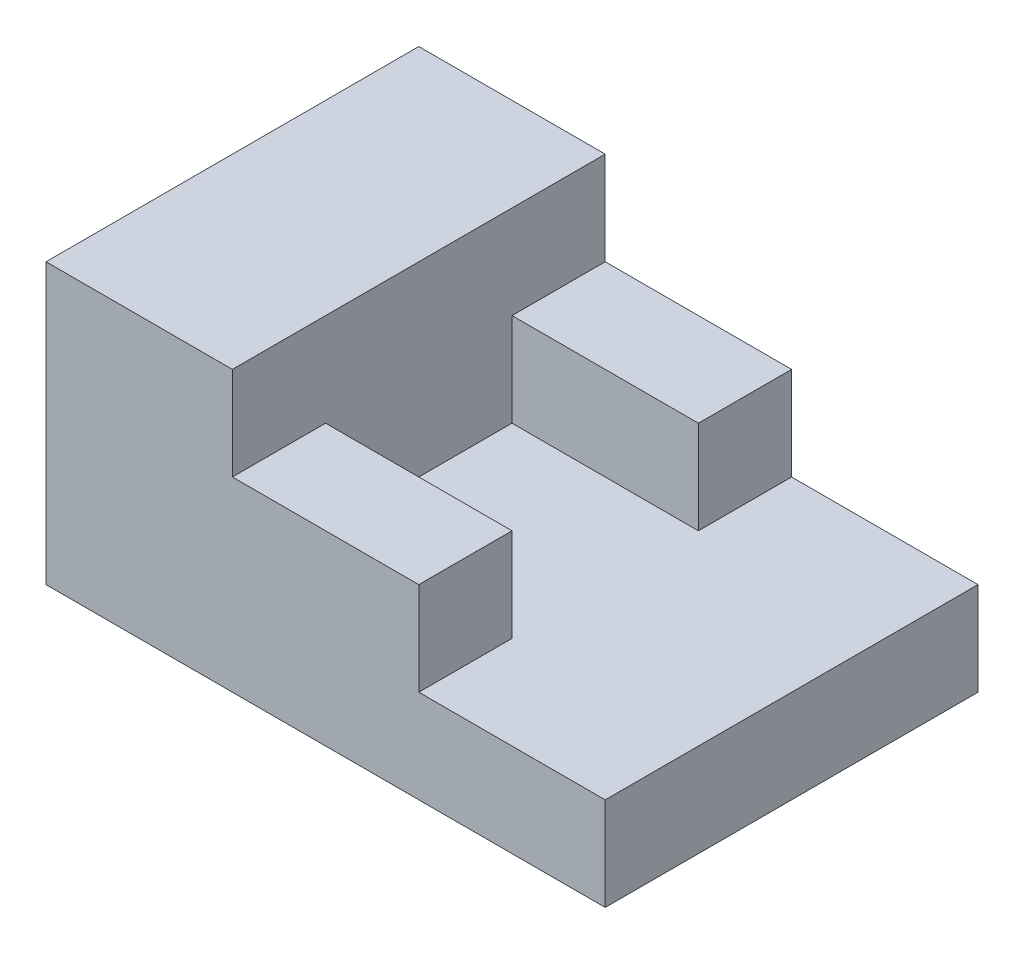
ISO-10303-21;
HEADER;
FILE_DESCRIPTION(('STEP AP214'),'2;1');
FILE_NAME('part.step','',(''),(''),'','','');
FILE_SCHEMA(('AUTOMOTIVE_DESIGN { 1 0 10303 214 1 1 1 1 }'));
ENDSEC;
DATA;
#1=APPLICATION_CONTEXT('core data for automotive mechanical design processes');
#2=APPLICATION_PROTOCOL_DEFINITION('international standard','automotive_design',2000,#1);
#3=PRODUCT_CONTEXT('',#1,'mechanical');
#4=PRODUCT('Part','Part','',(#3));
#5=PRODUCT_RELATED_PRODUCT_CATEGORY('part','',(#4));
#6=PRODUCT_DEFINITION_FORMATION('','',#4);
#7=PRODUCT_DEFINITION_CONTEXT('part definition',#1,'design');
#8=PRODUCT_DEFINITION('design','',#6,#7);
#9=PRODUCT_DEFINITION_SHAPE('','',#8);
#10=(LENGTH_UNIT() NAMED_UNIT(*) SI_UNIT(.MILLI.,.METRE.));
#11=(NAMED_UNIT(*) PLANE_ANGLE_UNIT() SI_UNIT($,.RADIAN.));
#12=(NAMED_UNIT(*) SI_UNIT($,.STERADIAN.) SOLID_ANGLE_UNIT());
#13=UNCERTAINTY_MEASURE_WITH_UNIT(LENGTH_MEASURE(1.E-05),#10,'distance_accuracy_value','');
#14=(GEOMETRIC_REPRESENTATION_CONTEXT(3) GLOBAL_UNCERTAINTY_ASSIGNED_CONTEXT((#13)) GLOBAL_UNIT_ASSIGNED_CONTEXT((#10,
#11,#12)) REPRESENTATION_CONTEXT('',''));
#15=CARTESIAN_POINT('',(0.,0.,0.));
#16=DIRECTION('',(0.,0.,1.));
#17=DIRECTION('',(1.,0.,0.));
#18=AXIS2_PLACEMENT_3D('',#15,#16,#17);
#19=CARTESIAN_POINT('',(0.,10.,0.));
#20=DIRECTION('',(0.,1.,0.));
#21=DIRECTION('',(0.,0.,1.));
#22=AXIS2_PLACEMENT_3D('',#19,#20,#21);
#23=PLANE('',#22);
#24=DIRECTION('',(0.,0.,-1.));
#25=VECTOR('',#24,1.);
#26=CARTESIAN_POINT('',(-5.,10.,0.));
#27=LINE('',#26,#25);
#28=CARTESIAN_POINT('',(-5.,10.,10.));
#29=VERTEX_POINT('',#28);
#30=CARTESIAN_POINT('',(-5.,10.,5.));
#31=VERTEX_POINT('',#30);
#32=EDGE_CURVE('E11',#29,#31,#27,.T.);
#33=ORIENTED_EDGE('',*,*,#32,.F.);
#34=DIRECTION('',(1.,0.,0.));
#35=VECTOR('',#34,1.);
#36=CARTESIAN_POINT('',(0.,10.,10.));
#37=LINE('',#36,#35);
#38=CARTESIAN_POINT('',(5.,10.,10.));
#39=VERTEX_POINT('',#38);
#40=EDGE_CURVE('E169',#29,#39,#37,.T.);
#41=ORIENTED_EDGE('',*,*,#40,.T.);
#42=DIRECTION('',(0.,0.,1.));
#43=VECTOR('',#42,1.);
#44=CARTESIAN_POINT('',(5.,10.,0.));
#45=LINE('',#44,#43);
#46=CARTESIAN_POINT('',(5.,10.,5.));
#47=VERTEX_POINT('',#46);
#48=EDGE_CURVE('E171',#47,#39,#45,.T.);
#49=ORIENTED_EDGE('',*,*,#48,.F.);
#50=DIRECTION('',(1.,0.,0.));
#51=VECTOR('',#50,1.);
#52=CARTESIAN_POINT('',(0.,10.,5.));
#53=LINE('',#52,#51);
#54=EDGE_CURVE('E174',#31,#47,#53,.T.);
#55=ORIENTED_EDGE('',*,*,#54,.F.);
#56=EDGE_LOOP('',(#33,#41,#49,#55));
#57=FACE_BOUND('',#56,.T.);
#58=ADVANCED_FACE('F39',(#57),#23,.T.);
#59=CARTESIAN_POINT('',(0.,5.,0.));
#60=DIRECTION('',(0.,1.,0.));
#61=DIRECTION('',(0.,0.,1.));
#62=AXIS2_PLACEMENT_3D('',#59,#60,#61);
#63=PLANE('',#62);
#64=DIRECTION('',(1.,0.,0.));
#65=VECTOR('',#64,1.);
#66=CARTESIAN_POINT('',(0.,5.,-10.));
#67=LINE('',#66,#65);
#68=CARTESIAN_POINT('',(5.,5.,-10.));
#69=VERTEX_POINT('',#68);
#70=CARTESIAN_POINT('',(15.,5.,-10.));
#71=VERTEX_POINT('',#70);
#72=EDGE_CURVE('E140',#69,#71,#67,.T.);
#73=ORIENTED_EDGE('',*,*,#72,.F.);
#74=DIRECTION('',(0.,0.,1.));
#75=VECTOR('',#74,1.);
#76=CARTESIAN_POINT('',(5.,5.,0.));
#77=LINE('',#76,#75);
#78=CARTESIAN_POINT('',(5.,5.,-5.));
#79=VERTEX_POINT('',#78);
#80=EDGE_CURVE('E60',#69,#79,#77,.T.);
#81=ORIENTED_EDGE('',*,*,#80,.T.);
#82=DIRECTION('',(-1.,0.,0.));
#83=VECTOR('',#82,1.);
#84=CARTESIAN_POINT('',(0.,5.,-5.));
#85=LINE('',#84,#83);
#86=CARTESIAN_POINT('',(-5.,5.,-5.));
#87=VERTEX_POINT('',#86);
#88=EDGE_CURVE('E205',#79,#87,#85,.T.);
#89=ORIENTED_EDGE('',*,*,#88,.T.);
#90=DIRECTION('',(0.,0.,-1.));
#91=VECTOR('',#90,1.);
#92=CARTESIAN_POINT('',(-5.,5.,0.));
#93=LINE('',#92,#91);
#94=CARTESIAN_POINT('',(-5.,5.,5.));
#95=VERTEX_POINT('',#94);
#96=EDGE_CURVE('E195',#95,#87,#93,.T.);
#97=ORIENTED_EDGE('',*,*,#96,.F.);
#98=DIRECTION('',(-1.,0.,0.));
#99=VECTOR('',#98,1.);
#100=CARTESIAN_POINT('',(0.,5.,5.));
#101=LINE('',#100,#99);
#102=CARTESIAN_POINT('',(5.,5.,5.));
#103=VERTEX_POINT('',#102);
#104=EDGE_CURVE('E198',#103,#95,#101,.T.);
#105=ORIENTED_EDGE('',*,*,#104,.F.);
#106=DIRECTION('',(0.,0.,-1.));
#107=VECTOR('',#106,1.);
#108=CARTESIAN_POINT('',(5.,5.,0.));
#109=LINE('',#108,#107);
#110=CARTESIAN_POINT('',(5.,5.,10.));
#111=VERTEX_POINT('',#110);
#112=EDGE_CURVE('E201',#111,#103,#109,.T.);
#113=ORIENTED_EDGE('',*,*,#112,.F.);
#114=DIRECTION('',(1.,0.,0.));
#115=VECTOR('',#114,1.);
#116=CARTESIAN_POINT('',(0.,5.,10.));
#117=LINE('',#116,#115);
#118=CARTESIAN_POINT('',(15.,5.,10.));
#119=VERTEX_POINT('',#118);
#120=EDGE_CURVE('E208',#111,#119,#117,.T.);
#121=ORIENTED_EDGE('',*,*,#120,.T.);
#122=DIRECTION('',(0.,0.,-1.));
#123=VECTOR('',#122,1.);
#124=CARTESIAN_POINT('',(15.,5.,0.));
#125=LINE('',#124,#123);
#126=EDGE_CURVE('E210',#119,#71,#125,.T.);
#127=ORIENTED_EDGE('',*,*,#126,.T.);
#128=EDGE_LOOP('',(#73,#81,#89,#97,#105,#113,#121,#127));
#129=FACE_BOUND('',#128,.T.);
#130=ADVANCED_FACE('F239',(#129),#63,.T.);
#131=CARTESIAN_POINT('',(-15.,5.,0.));
#132=DIRECTION('',(-1.,0.,0.));
#133=DIRECTION('',(0.,0.,1.));
#134=AXIS2_PLACEMENT_3D('',#131,#132,#133);
#135=PLANE('',#134);
#136=DIRECTION('',(0.,0.,-1.));
#137=VECTOR('',#136,1.);
#138=CARTESIAN_POINT('',(-15.,0.,0.));
#139=LINE('',#138,#137);
#140=CARTESIAN_POINT('',(-15.,0.,10.));
#141=VERTEX_POINT('',#140);
#142=CARTESIAN_POINT('',(-15.,0.,-10.));
#143=VERTEX_POINT('',#142);
#144=EDGE_CURVE('E207',#141,#143,#139,.T.);
#145=ORIENTED_EDGE('',*,*,#144,.F.);
#146=DIRECTION('',(0.,-1.,0.));
#147=VECTOR('',#146,1.);
#148=CARTESIAN_POINT('',(-15.,5.,10.));
#149=LINE('',#148,#147);
#150=CARTESIAN_POINT('',(-15.,15.,10.));
#151=VERTEX_POINT('',#150);
#152=EDGE_CURVE('E149',#151,#141,#149,.T.);
#153=ORIENTED_EDGE('',*,*,#152,.F.);
#154=DIRECTION('',(0.,0.,-1.));
#155=VECTOR('',#154,1.);
#156=CARTESIAN_POINT('',(-15.,15.,0.));
#157=LINE('',#156,#155);
#158=CARTESIAN_POINT('',(-15.,15.,-10.));
#159=VERTEX_POINT('',#158);
#160=EDGE_CURVE('E145',#151,#159,#157,.T.);
#161=ORIENTED_EDGE('',*,*,#160,.T.);
#162=DIRECTION('',(0.,-1.,0.));
#163=VECTOR('',#162,1.);
#164=CARTESIAN_POINT('',(-15.,5.,-10.));
#165=LINE('',#164,#163);
#166=EDGE_CURVE('E127',#159,#143,#165,.T.);
#167=ORIENTED_EDGE('',*,*,#166,.T.);
#168=EDGE_LOOP('',(#145,#153,#161,#167));
#169=FACE_BOUND('',#168,.T.);
#170=ADVANCED_FACE('F41',(#169),#135,.T.);
#171=CARTESIAN_POINT('',(0.,5.,10.));
#172=DIRECTION('',(0.,0.,-1.));
#173=DIRECTION('',(-1.,0.,0.));
#174=AXIS2_PLACEMENT_3D('',#171,#172,#173);
#175=PLANE('',#174);
#176=ORIENTED_EDGE('',*,*,#40,.F.);
#177=DIRECTION('',(0.,-1.,0.));
#178=VECTOR('',#177,1.);
#179=CARTESIAN_POINT('',(-5.,15.,10.));
#180=LINE('',#179,#178);
#181=CARTESIAN_POINT('',(-5.,15.,10.));
#182=VERTEX_POINT('',#181);
#183=EDGE_CURVE('E158',#182,#29,#180,.T.);
#184=ORIENTED_EDGE('',*,*,#183,.F.);
#185=DIRECTION('',(1.,0.,0.));
#186=VECTOR('',#185,1.);
#187=CARTESIAN_POINT('',(0.,15.,10.));
#188=LINE('',#187,#186);
#189=EDGE_CURVE('E151',#151,#182,#188,.T.);
#190=ORIENTED_EDGE('',*,*,#189,.F.);
#191=ORIENTED_EDGE('',*,*,#152,.T.);
#192=DIRECTION('',(1.,0.,0.));
#193=VECTOR('',#192,1.);
#194=CARTESIAN_POINT('',(0.,0.,10.));
#195=LINE('',#194,#193);
#196=CARTESIAN_POINT('',(15.,0.,10.));
#197=VERTEX_POINT('',#196);
#198=EDGE_CURVE('E215',#141,#197,#195,.T.);
#199=ORIENTED_EDGE('',*,*,#198,.T.);
#200=DIRECTION('',(0.,-1.,0.));
#201=VECTOR('',#200,1.);
#202=CARTESIAN_POINT('',(15.,5.,10.));
#203=LINE('',#202,#201);
#204=EDGE_CURVE('E222',#119,#197,#203,.T.);
#205=ORIENTED_EDGE('',*,*,#204,.F.);
#206=ORIENTED_EDGE('',*,*,#120,.F.);
#207=DIRECTION('',(0.,-1.,0.));
#208=VECTOR('',#207,1.);
#209=CARTESIAN_POINT('',(5.,10.,10.));
#210=LINE('',#209,#208);
#211=EDGE_CURVE('E186',#39,#111,#210,.T.);
#212=ORIENTED_EDGE('',*,*,#211,.F.);
#213=EDGE_LOOP('',(#176,#184,#190,#191,#199,#205,#206,#212));
#214=FACE_BOUND('',#213,.T.);
#215=ADVANCED_FACE('F248',(#214),#175,.F.);
#216=CARTESIAN_POINT('',(15.,5.,0.));
#217=DIRECTION('',(-1.,0.,0.));
#218=DIRECTION('',(0.,0.,1.));
#219=AXIS2_PLACEMENT_3D('',#216,#217,#218);
#220=PLANE('',#219);
#221=DIRECTION('',(0.,0.,-1.));
#222=VECTOR('',#221,1.);
#223=CARTESIAN_POINT('',(15.,0.,0.));
#224=LINE('',#223,#222);
#225=CARTESIAN_POINT('',(15.,0.,-10.));
#226=VERTEX_POINT('',#225);
#227=EDGE_CURVE('E217',#197,#226,#224,.T.);
#228=ORIENTED_EDGE('',*,*,#227,.T.);
#229=DIRECTION('',(0.,-1.,0.));
#230=VECTOR('',#229,1.);
#231=CARTESIAN_POINT('',(15.,5.,-10.));
#232=LINE('',#231,#230);
#233=EDGE_CURVE('E139',#71,#226,#232,.T.);
#234=ORIENTED_EDGE('',*,*,#233,.F.);
#235=ORIENTED_EDGE('',*,*,#126,.F.);
#236=ORIENTED_EDGE('',*,*,#204,.T.);
#237=EDGE_LOOP('',(#228,#234,#235,#236));
#238=FACE_BOUND('',#237,.T.);
#239=ADVANCED_FACE('F253',(#238),#220,.F.);
#240=CARTESIAN_POINT('',(0.,5.,-10.));
#241=DIRECTION('',(0.,0.,-1.));
#242=DIRECTION('',(-1.,0.,0.));
#243=AXIS2_PLACEMENT_3D('',#240,#241,#242);
#244=PLANE('',#243);
#245=ORIENTED_EDGE('',*,*,#233,.T.);
#246=DIRECTION('',(1.,0.,0.));
#247=VECTOR('',#246,1.);
#248=CARTESIAN_POINT('',(0.,0.,-10.));
#249=LINE('',#248,#247);
#250=EDGE_CURVE('E134',#143,#226,#249,.T.);
#251=ORIENTED_EDGE('',*,*,#250,.F.);
#252=ORIENTED_EDGE('',*,*,#166,.F.);
#253=DIRECTION('',(1.,0.,0.));
#254=VECTOR('',#253,1.);
#255=CARTESIAN_POINT('',(0.,15.,-10.));
#256=LINE('',#255,#254);
#257=CARTESIAN_POINT('',(-5.,15.,-10.));
#258=VERTEX_POINT('',#257);
#259=EDGE_CURVE('E132',#159,#258,#256,.T.);
#260=ORIENTED_EDGE('',*,*,#259,.T.);
#261=DIRECTION('',(0.,-1.,0.));
#262=VECTOR('',#261,1.);
#263=CARTESIAN_POINT('',(-5.,15.,-10.));
#264=LINE('',#263,#262);
#265=CARTESIAN_POINT('',(-5.,10.,-10.));
#266=VERTEX_POINT('',#265);
#267=EDGE_CURVE('E156',#258,#266,#264,.T.);
#268=ORIENTED_EDGE('',*,*,#267,.T.);
#269=DIRECTION('',(1.,0.,0.));
#270=VECTOR('',#269,1.);
#271=CARTESIAN_POINT('',(0.,10.,-10.));
#272=LINE('',#271,#270);
#273=CARTESIAN_POINT('',(5.,10.,-10.));
#274=VERTEX_POINT('',#273);
#275=EDGE_CURVE('E167',#266,#274,#272,.T.);
#276=ORIENTED_EDGE('',*,*,#275,.T.);
#277=DIRECTION('',(0.,-1.,0.));
#278=VECTOR('',#277,1.);
#279=CARTESIAN_POINT('',(5.,10.,-10.));
#280=LINE('',#279,#278);
#281=EDGE_CURVE('E189',#274,#69,#280,.T.);
#282=ORIENTED_EDGE('',*,*,#281,.T.);
#283=ORIENTED_EDGE('',*,*,#72,.T.);
#284=EDGE_LOOP('',(#245,#251,#252,#260,#268,#276,#282,#283));
#285=FACE_BOUND('',#284,.T.);
#286=ADVANCED_FACE('F130',(#285),#244,.T.);
#287=CARTESIAN_POINT('',(0.,0.,0.));
#288=DIRECTION('',(0.,1.,0.));
#289=DIRECTION('',(0.,0.,1.));
#290=AXIS2_PLACEMENT_3D('',#287,#288,#289);
#291=PLANE('',#290);
#292=ORIENTED_EDGE('',*,*,#227,.F.);
#293=ORIENTED_EDGE('',*,*,#198,.F.);
#294=ORIENTED_EDGE('',*,*,#144,.T.);
#295=ORIENTED_EDGE('',*,*,#250,.T.);
#296=EDGE_LOOP('',(#292,#293,#294,#295));
#297=FACE_BOUND('',#296,.T.);
#298=ADVANCED_FACE('F255',(#297),#291,.F.);
#299=CARTESIAN_POINT('',(0.,10.,-5.));
#300=DIRECTION('',(0.,0.,-1.));
#301=DIRECTION('',(-1.,0.,0.));
#302=AXIS2_PLACEMENT_3D('',#299,#300,#301);
#303=PLANE('',#302);
#304=ORIENTED_EDGE('',*,*,#88,.F.);
#305=DIRECTION('',(0.,-1.,0.));
#306=VECTOR('',#305,1.);
#307=CARTESIAN_POINT('',(5.,10.,-5.));
#308=LINE('',#307,#306);
#309=CARTESIAN_POINT('',(5.,10.,-5.));
#310=VERTEX_POINT('',#309);
#311=EDGE_CURVE('E192',#310,#79,#308,.T.);
#312=ORIENTED_EDGE('',*,*,#311,.F.);
#313=DIRECTION('',(1.,0.,0.));
#314=VECTOR('',#313,1.);
#315=CARTESIAN_POINT('',(0.,10.,-5.));
#316=LINE('',#315,#314);
#317=CARTESIAN_POINT('',(-5.,10.,-5.));
#318=VERTEX_POINT('',#317);
#319=EDGE_CURVE('E161',#318,#310,#316,.T.);
#320=ORIENTED_EDGE('',*,*,#319,.F.);
#321=DIRECTION('',(0.,-1.,0.));
#322=VECTOR('',#321,1.);
#323=CARTESIAN_POINT('',(-5.,10.,-5.));
#324=LINE('',#323,#322);
#325=EDGE_CURVE('E177',#318,#87,#324,.T.);
#326=ORIENTED_EDGE('',*,*,#325,.T.);
#327=EDGE_LOOP('',(#304,#312,#320,#326));
#328=FACE_BOUND('',#327,.T.);
#329=ADVANCED_FACE('F238',(#328),#303,.F.);
#330=CARTESIAN_POINT('',(5.,10.,0.));
#331=DIRECTION('',(-1.,0.,0.));
#332=DIRECTION('',(0.,0.,1.));
#333=AXIS2_PLACEMENT_3D('',#330,#331,#332);
#334=PLANE('',#333);
#335=ORIENTED_EDGE('',*,*,#80,.F.);
#336=ORIENTED_EDGE('',*,*,#281,.F.);
#337=DIRECTION('',(0.,0.,-1.));
#338=VECTOR('',#337,1.);
#339=CARTESIAN_POINT('',(5.,10.,0.));
#340=LINE('',#339,#338);
#341=EDGE_CURVE('E164',#310,#274,#340,.T.);
#342=ORIENTED_EDGE('',*,*,#341,.F.);
#343=ORIENTED_EDGE('',*,*,#311,.T.);
#344=EDGE_LOOP('',(#335,#336,#342,#343));
#345=FACE_BOUND('',#344,.T.);
#346=ADVANCED_FACE('F236',(#345),#334,.F.);
#347=CARTESIAN_POINT('',(5.,10.,0.));
#348=DIRECTION('',(1.,0.,0.));
#349=DIRECTION('',(0.,0.,-1.));
#350=AXIS2_PLACEMENT_3D('',#347,#348,#349);
#351=PLANE('',#350);
#352=ORIENTED_EDGE('',*,*,#211,.T.);
#353=ORIENTED_EDGE('',*,*,#112,.T.);
#354=DIRECTION('',(0.,-1.,0.));
#355=VECTOR('',#354,1.);
#356=CARTESIAN_POINT('',(5.,10.,5.));
#357=LINE('',#356,#355);
#358=EDGE_CURVE('E183',#47,#103,#357,.T.);
#359=ORIENTED_EDGE('',*,*,#358,.F.);
#360=ORIENTED_EDGE('',*,*,#48,.T.);
#361=EDGE_LOOP('',(#352,#353,#359,#360));
#362=FACE_BOUND('',#361,.T.);
#363=ADVANCED_FACE('F245',(#362),#351,.T.);
#364=CARTESIAN_POINT('',(0.,10.,5.));
#365=DIRECTION('',(0.,0.,-1.));
#366=DIRECTION('',(-1.,0.,0.));
#367=AXIS2_PLACEMENT_3D('',#364,#365,#366);
#368=PLANE('',#367);
#369=ORIENTED_EDGE('',*,*,#358,.T.);
#370=ORIENTED_EDGE('',*,*,#104,.T.);
#371=DIRECTION('',(0.,-1.,0.));
#372=VECTOR('',#371,1.);
#373=CARTESIAN_POINT('',(-5.,10.,5.));
#374=LINE('',#373,#372);
#375=EDGE_CURVE('E180',#31,#95,#374,.T.);
#376=ORIENTED_EDGE('',*,*,#375,.F.);
#377=ORIENTED_EDGE('',*,*,#54,.T.);
#378=EDGE_LOOP('',(#369,#370,#376,#377));
#379=FACE_BOUND('',#378,.T.);
#380=ADVANCED_FACE('F241',(#379),#368,.T.);
#381=CARTESIAN_POINT('',(-5.,10.,0.));
#382=DIRECTION('',(1.,0.,0.));
#383=DIRECTION('',(0.,0.,-1.));
#384=AXIS2_PLACEMENT_3D('',#381,#382,#383);
#385=PLANE('',#384);
#386=ORIENTED_EDGE('',*,*,#375,.T.);
#387=ORIENTED_EDGE('',*,*,#96,.T.);
#388=ORIENTED_EDGE('',*,*,#325,.F.);
#389=EDGE_CURVE('E43',#318,#266,#27,.T.);
#390=ORIENTED_EDGE('',*,*,#389,.T.);
#391=ORIENTED_EDGE('',*,*,#267,.F.);
#392=DIRECTION('',(0.,0.,1.));
#393=VECTOR('',#392,1.);
#394=CARTESIAN_POINT('',(-5.,15.,0.));
#395=LINE('',#394,#393);
#396=EDGE_CURVE('E147',#258,#182,#395,.T.);
#397=ORIENTED_EDGE('',*,*,#396,.T.);
#398=ORIENTED_EDGE('',*,*,#183,.T.);
#399=ORIENTED_EDGE('',*,*,#32,.T.);
#400=EDGE_LOOP('',(#386,#387,#388,#390,#391,#397,#398,#399));
#401=FACE_BOUND('',#400,.T.);
#402=ADVANCED_FACE('F229',(#401),#385,.T.);
#403=ORIENTED_EDGE('',*,*,#389,.F.);
#404=ORIENTED_EDGE('',*,*,#319,.T.);
#405=ORIENTED_EDGE('',*,*,#341,.T.);
#406=ORIENTED_EDGE('',*,*,#275,.F.);
#407=EDGE_LOOP('',(#403,#404,#405,#406));
#408=FACE_BOUND('',#407,.T.);
#409=ADVANCED_FACE('F233',(#408),#23,.T.);
#410=CARTESIAN_POINT('',(0.,15.,0.));
#411=DIRECTION('',(0.,1.,0.));
#412=DIRECTION('',(0.,0.,1.));
#413=AXIS2_PLACEMENT_3D('',#410,#411,#412);
#414=PLANE('',#413);
#415=ORIENTED_EDGE('',*,*,#259,.F.);
#416=ORIENTED_EDGE('',*,*,#160,.F.);
#417=ORIENTED_EDGE('',*,*,#189,.T.);
#418=ORIENTED_EDGE('',*,*,#396,.F.);
#419=EDGE_LOOP('',(#415,#416,#417,#418));
#420=FACE_BOUND('',#419,.T.);
#421=ADVANCED_FACE('F144',(#420),#414,.T.);
#422=CLOSED_SHELL('',(#58,#130,#170,#215,#239,#286,#298,#329,#346,#363,#380,#402,#409,#421));
#423=MANIFOLD_SOLID_BREP('B2',#422);
#424=ADVANCED_BREP_SHAPE_REPRESENTATION('',(#18,#423),#14);
#425=SHAPE_DEFINITION_REPRESENTATION(#9,#424);
ENDSEC;
END-ISO-10303-21;
